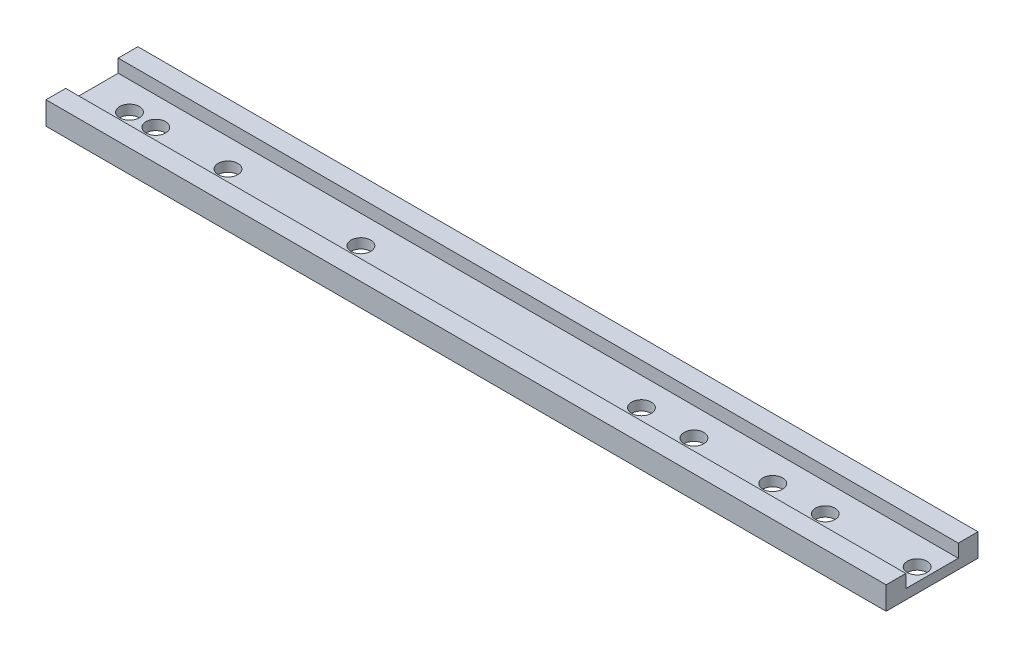
ISO-10303-21;
HEADER;
FILE_DESCRIPTION(('STEP AP214'),'2;1');
FILE_NAME('part.step','',(''),(''),'','','');
FILE_SCHEMA(('AUTOMOTIVE_DESIGN { 1 0 10303 214 1 1 1 1 }'));
ENDSEC;
DATA;
#1=APPLICATION_CONTEXT('core data for automotive mechanical design processes');
#2=APPLICATION_PROTOCOL_DEFINITION('international standard','automotive_design',2000,#1);
#3=PRODUCT_CONTEXT('',#1,'mechanical');
#4=PRODUCT('Part','Part','',(#3));
#5=PRODUCT_RELATED_PRODUCT_CATEGORY('part','',(#4));
#6=PRODUCT_DEFINITION_FORMATION('','',#4);
#7=PRODUCT_DEFINITION_CONTEXT('part definition',#1,'design');
#8=PRODUCT_DEFINITION('design','',#6,#7);
#9=PRODUCT_DEFINITION_SHAPE('','',#8);
#10=(LENGTH_UNIT() NAMED_UNIT(*) SI_UNIT(.MILLI.,.METRE.));
#11=(NAMED_UNIT(*) PLANE_ANGLE_UNIT() SI_UNIT($,.RADIAN.));
#12=(NAMED_UNIT(*) SI_UNIT($,.STERADIAN.) SOLID_ANGLE_UNIT());
#13=UNCERTAINTY_MEASURE_WITH_UNIT(LENGTH_MEASURE(1.E-05),#10,'distance_accuracy_value','');
#14=(GEOMETRIC_REPRESENTATION_CONTEXT(3) GLOBAL_UNCERTAINTY_ASSIGNED_CONTEXT((#13)) GLOBAL_UNIT_ASSIGNED_CONTEXT((#10,
#11,#12)) REPRESENTATION_CONTEXT('',''));
#15=CARTESIAN_POINT('',(0.,0.,0.));
#16=DIRECTION('',(0.,0.,1.));
#17=DIRECTION('',(1.,0.,0.));
#18=AXIS2_PLACEMENT_3D('',#15,#16,#17);
#19=CARTESIAN_POINT('',(211.2,6.88409090909091,11.825));
#20=DIRECTION('',(0.,-1.,0.));
#21=DIRECTION('',(0.,0.,-1.));
#22=AXIS2_PLACEMENT_3D('',#19,#20,#21);
#23=PLANE('',#22);
#24=DIRECTION('',(0.,0.,1.));
#25=VECTOR('',#24,1.);
#26=CARTESIAN_POINT('',(-195.2,6.88409090909091,11.825));
#27=LINE('',#26,#25);
#28=CARTESIAN_POINT('',(-195.2,6.88409090909091,11.825));
#29=VERTEX_POINT('',#28);
#30=CARTESIAN_POINT('',(-195.2,6.88409090909091,21.35));
#31=VERTEX_POINT('',#30);
#32=EDGE_CURVE('E134',#29,#31,#27,.T.);
#33=ORIENTED_EDGE('',*,*,#32,.T.);
#34=DIRECTION('',(-1.,0.,0.));
#35=VECTOR('',#34,1.);
#36=CARTESIAN_POINT('',(211.2,6.88409090909091,21.35));
#37=LINE('',#36,#35);
#38=CARTESIAN_POINT('',(211.2,6.88409090909091,21.35));
#39=VERTEX_POINT('',#38);
#40=EDGE_CURVE('E11',#39,#31,#37,.T.);
#41=ORIENTED_EDGE('',*,*,#40,.F.);
#42=DIRECTION('',(0.,0.,1.));
#43=VECTOR('',#42,1.);
#44=CARTESIAN_POINT('',(211.2,6.88409090909091,11.825));
#45=LINE('',#44,#43);
#46=CARTESIAN_POINT('',(211.2,6.88409090909091,11.825));
#47=VERTEX_POINT('',#46);
#48=EDGE_CURVE('E149',#47,#39,#45,.T.);
#49=ORIENTED_EDGE('',*,*,#48,.F.);
#50=DIRECTION('',(-1.,0.,0.));
#51=VECTOR('',#50,1.);
#52=CARTESIAN_POINT('',(211.2,6.88409090909091,11.825));
#53=LINE('',#52,#51);
#54=EDGE_CURVE('E130',#47,#29,#53,.T.);
#55=ORIENTED_EDGE('',*,*,#54,.T.);
#56=EDGE_LOOP('',(#33,#41,#49,#55));
#57=FACE_BOUND('',#56,.T.);
#58=ADVANCED_FACE('F36',(#57),#23,.F.);
#59=CARTESIAN_POINT('',(211.2,6.88409090909091,21.35));
#60=DIRECTION('',(0.,0.,-1.));
#61=DIRECTION('',(-1.,0.,0.));
#62=AXIS2_PLACEMENT_3D('',#59,#60,#61);
#63=PLANE('',#62);
#64=DIRECTION('',(0.,-1.,0.));
#65=VECTOR('',#64,1.);
#66=CARTESIAN_POINT('',(-195.2,6.88409090909091,21.35));
#67=LINE('',#66,#65);
#68=CARTESIAN_POINT('',(-195.2,-4.22840909090909,21.35));
#69=VERTEX_POINT('',#68);
#70=EDGE_CURVE('E137',#31,#69,#67,.T.);
#71=ORIENTED_EDGE('',*,*,#70,.T.);
#72=DIRECTION('',(-1.,0.,0.));
#73=VECTOR('',#72,1.);
#74=CARTESIAN_POINT('',(211.2,-4.22840909090909,21.35));
#75=LINE('',#74,#73);
#76=CARTESIAN_POINT('',(211.2,-4.22840909090909,21.35));
#77=VERTEX_POINT('',#76);
#78=EDGE_CURVE('E45',#77,#69,#75,.T.);
#79=ORIENTED_EDGE('',*,*,#78,.F.);
#80=DIRECTION('',(0.,-1.,0.));
#81=VECTOR('',#80,1.);
#82=CARTESIAN_POINT('',(211.2,6.88409090909091,21.35));
#83=LINE('',#82,#81);
#84=EDGE_CURVE('E97',#39,#77,#83,.T.);
#85=ORIENTED_EDGE('',*,*,#84,.F.);
#86=ORIENTED_EDGE('',*,*,#40,.T.);
#87=EDGE_LOOP('',(#71,#79,#85,#86));
#88=FACE_BOUND('',#87,.T.);
#89=ADVANCED_FACE('F248',(#88),#63,.F.);
#90=CARTESIAN_POINT('',(211.2,-4.22840909090909,21.35));
#91=DIRECTION('',(0.,1.,0.));
#92=DIRECTION('',(0.,0.,1.));
#93=AXIS2_PLACEMENT_3D('',#90,#91,#92);
#94=PLANE('',#93);
#95=CARTESIAN_POINT('',(204.85,-4.22840909090909,0.));
#96=DIRECTION('',(0.,-1.,0.));
#97=DIRECTION('',(0.,0.,-1.));
#98=AXIS2_PLACEMENT_3D('',#95,#96,#97);
#99=CIRCLE('',#98,4.76250000000001);
#100=CARTESIAN_POINT('',(204.85,-4.22840909090909,-4.76250000000001));
#101=VERTEX_POINT('',#100);
#102=EDGE_CURVE('E199',#101,#101,#99,.T.);
#103=ORIENTED_EDGE('',*,*,#102,.F.);
#104=EDGE_LOOP('',(#103));
#105=FACE_BOUND('',#104,.T.);
#106=CARTESIAN_POINT('',(160.4,-4.22840909090909,0.));
#107=DIRECTION('',(0.,-1.,0.));
#108=DIRECTION('',(0.,0.,-1.));
#109=AXIS2_PLACEMENT_3D('',#106,#107,#108);
#110=CIRCLE('',#109,4.76250000000001);
#111=CARTESIAN_POINT('',(160.4,-4.22840909090909,-4.76250000000001));
#112=VERTEX_POINT('',#111);
#113=EDGE_CURVE('E189',#112,#112,#110,.T.);
#114=ORIENTED_EDGE('',*,*,#113,.F.);
#115=EDGE_LOOP('',(#114));
#116=FACE_BOUND('',#115,.T.);
#117=CARTESIAN_POINT('',(135.,-4.22840909090909,0.));
#118=DIRECTION('',(0.,-1.,0.));
#119=DIRECTION('',(0.,0.,-1.));
#120=AXIS2_PLACEMENT_3D('',#117,#118,#119);
#121=CIRCLE('',#120,4.76250000000001);
#122=CARTESIAN_POINT('',(135.,-4.22840909090909,-4.76250000000001));
#123=VERTEX_POINT('',#122);
#124=EDGE_CURVE('E186',#123,#123,#121,.T.);
#125=ORIENTED_EDGE('',*,*,#124,.F.);
#126=EDGE_LOOP('',(#125));
#127=FACE_BOUND('',#126,.T.);
#128=CARTESIAN_POINT('',(96.9,-4.22840909090909,0.));
#129=DIRECTION('',(0.,-1.,0.));
#130=DIRECTION('',(0.,0.,-1.));
#131=AXIS2_PLACEMENT_3D('',#128,#129,#130);
#132=CIRCLE('',#131,4.7625);
#133=CARTESIAN_POINT('',(96.9,-4.22840909090909,-4.7625));
#134=VERTEX_POINT('',#133);
#135=EDGE_CURVE('E183',#134,#134,#132,.T.);
#136=ORIENTED_EDGE('',*,*,#135,.F.);
#137=EDGE_LOOP('',(#136));
#138=FACE_BOUND('',#137,.T.);
#139=CARTESIAN_POINT('',(71.5,-4.22840909090909,0.));
#140=DIRECTION('',(0.,-1.,0.));
#141=DIRECTION('',(0.,0.,-1.));
#142=AXIS2_PLACEMENT_3D('',#139,#140,#141);
#143=CIRCLE('',#142,4.7625);
#144=CARTESIAN_POINT('',(71.5,-4.22840909090909,-4.7625));
#145=VERTEX_POINT('',#144);
#146=EDGE_CURVE('E179',#145,#145,#143,.T.);
#147=ORIENTED_EDGE('',*,*,#146,.F.);
#148=EDGE_LOOP('',(#147));
#149=FACE_BOUND('',#148,.T.);
#150=CARTESIAN_POINT('',(-64.23125,-4.22840909090909,0.));
#151=DIRECTION('',(0.,-1.,0.));
#152=DIRECTION('',(0.,0.,-1.));
#153=AXIS2_PLACEMENT_3D('',#150,#151,#152);
#154=CIRCLE('',#153,4.7625);
#155=CARTESIAN_POINT('',(-64.23125,-4.22840909090909,-4.7625));
#156=VERTEX_POINT('',#155);
#157=EDGE_CURVE('E175',#156,#156,#154,.T.);
#158=ORIENTED_EDGE('',*,*,#157,.F.);
#159=EDGE_LOOP('',(#158));
#160=FACE_BOUND('',#159,.T.);
#161=CARTESIAN_POINT('',(-128.525,-4.22840909090909,0.));
#162=DIRECTION('',(0.,-1.,0.));
#163=DIRECTION('',(0.,0.,-1.));
#164=AXIS2_PLACEMENT_3D('',#161,#162,#163);
#165=CIRCLE('',#164,4.7625);
#166=CARTESIAN_POINT('',(-128.525,-4.22840909090909,-4.7625));
#167=VERTEX_POINT('',#166);
#168=EDGE_CURVE('E171',#167,#167,#165,.T.);
#169=ORIENTED_EDGE('',*,*,#168,.F.);
#170=EDGE_LOOP('',(#169));
#171=FACE_BOUND('',#170,.T.);
#172=CARTESIAN_POINT('',(-163.45,-4.22840909090909,0.));
#173=DIRECTION('',(0.,-1.,0.));
#174=DIRECTION('',(0.,0.,-1.));
#175=AXIS2_PLACEMENT_3D('',#172,#173,#174);
#176=CIRCLE('',#175,4.76250000000001);
#177=CARTESIAN_POINT('',(-163.45,-4.22840909090909,-4.76250000000001));
#178=VERTEX_POINT('',#177);
#179=EDGE_CURVE('E167',#178,#178,#176,.T.);
#180=ORIENTED_EDGE('',*,*,#179,.F.);
#181=EDGE_LOOP('',(#180));
#182=FACE_BOUND('',#181,.T.);
#183=CARTESIAN_POINT('',(-176.15,-4.22840909090909,0.));
#184=DIRECTION('',(0.,-1.,0.));
#185=DIRECTION('',(0.,0.,-1.));
#186=AXIS2_PLACEMENT_3D('',#183,#184,#185);
#187=CIRCLE('',#186,4.76250000000001);
#188=CARTESIAN_POINT('',(-176.15,-4.22840909090909,-4.76250000000001));
#189=VERTEX_POINT('',#188);
#190=EDGE_CURVE('E163',#189,#189,#187,.T.);
#191=ORIENTED_EDGE('',*,*,#190,.F.);
#192=EDGE_LOOP('',(#191));
#193=FACE_BOUND('',#192,.T.);
#194=DIRECTION('',(0.,0.,-1.));
#195=VECTOR('',#194,1.);
#196=CARTESIAN_POINT('',(-195.2,-4.22840909090909,21.35));
#197=LINE('',#196,#195);
#198=CARTESIAN_POINT('',(-195.2,-4.22840909090909,-23.1));
#199=VERTEX_POINT('',#198);
#200=EDGE_CURVE('E140',#69,#199,#197,.T.);
#201=ORIENTED_EDGE('',*,*,#200,.T.);
#202=DIRECTION('',(-1.,0.,0.));
#203=VECTOR('',#202,1.);
#204=CARTESIAN_POINT('',(211.2,-4.22840909090909,-23.1));
#205=LINE('',#204,#203);
#206=CARTESIAN_POINT('',(211.2,-4.22840909090909,-23.1));
#207=VERTEX_POINT('',#206);
#208=EDGE_CURVE('E156',#207,#199,#205,.T.);
#209=ORIENTED_EDGE('',*,*,#208,.F.);
#210=DIRECTION('',(0.,0.,-1.));
#211=VECTOR('',#210,1.);
#212=CARTESIAN_POINT('',(211.2,-4.22840909090909,21.35));
#213=LINE('',#212,#211);
#214=EDGE_CURVE('E216',#77,#207,#213,.T.);
#215=ORIENTED_EDGE('',*,*,#214,.F.);
#216=ORIENTED_EDGE('',*,*,#78,.T.);
#217=EDGE_LOOP('',(#201,#209,#215,#216));
#218=FACE_BOUND('',#217,.T.);
#219=ADVANCED_FACE('F252',(#105,#116,#127,#138,#149,#160,#171,#182,#193,#218),#94,.F.);
#220=CARTESIAN_POINT('',(211.2,-4.22840909090909,-23.1));
#221=DIRECTION('',(0.,0.,1.));
#222=DIRECTION('',(0.,-1.,0.));
#223=AXIS2_PLACEMENT_3D('',#220,#221,#222);
#224=PLANE('',#223);
#225=DIRECTION('',(0.,1.,0.));
#226=VECTOR('',#225,1.);
#227=CARTESIAN_POINT('',(-195.2,-4.22840909090909,-23.1));
#228=LINE('',#227,#226);
#229=CARTESIAN_POINT('',(-195.2,6.88409090909091,-23.1));
#230=VERTEX_POINT('',#229);
#231=EDGE_CURVE('E142',#199,#230,#228,.T.);
#232=ORIENTED_EDGE('',*,*,#231,.T.);
#233=DIRECTION('',(-1.,0.,0.));
#234=VECTOR('',#233,1.);
#235=CARTESIAN_POINT('',(211.2,6.88409090909091,-23.1));
#236=LINE('',#235,#234);
#237=CARTESIAN_POINT('',(211.2,6.88409090909091,-23.1));
#238=VERTEX_POINT('',#237);
#239=EDGE_CURVE('E153',#238,#230,#236,.T.);
#240=ORIENTED_EDGE('',*,*,#239,.F.);
#241=DIRECTION('',(0.,1.,0.));
#242=VECTOR('',#241,1.);
#243=CARTESIAN_POINT('',(211.2,-4.22840909090909,-23.1));
#244=LINE('',#243,#242);
#245=EDGE_CURVE('E218',#207,#238,#244,.T.);
#246=ORIENTED_EDGE('',*,*,#245,.F.);
#247=ORIENTED_EDGE('',*,*,#208,.T.);
#248=EDGE_LOOP('',(#232,#240,#246,#247));
#249=FACE_BOUND('',#248,.T.);
#250=ADVANCED_FACE('F224',(#249),#224,.F.);
#251=CARTESIAN_POINT('',(211.2,6.88409090909091,-23.1));
#252=DIRECTION('',(0.,-1.,0.));
#253=DIRECTION('',(0.,0.,-1.));
#254=AXIS2_PLACEMENT_3D('',#251,#252,#253);
#255=PLANE('',#254);
#256=DIRECTION('',(0.,0.,1.));
#257=VECTOR('',#256,1.);
#258=CARTESIAN_POINT('',(-195.2,6.88409090909091,-23.1));
#259=LINE('',#258,#257);
#260=CARTESIAN_POINT('',(-195.2,6.88409090909091,-13.575));
#261=VERTEX_POINT('',#260);
#262=EDGE_CURVE('E144',#230,#261,#259,.T.);
#263=ORIENTED_EDGE('',*,*,#262,.T.);
#264=DIRECTION('',(-1.,0.,0.));
#265=VECTOR('',#264,1.);
#266=CARTESIAN_POINT('',(211.2,6.88409090909091,-13.575));
#267=LINE('',#266,#265);
#268=CARTESIAN_POINT('',(211.2,6.88409090909091,-13.575));
#269=VERTEX_POINT('',#268);
#270=EDGE_CURVE('E125',#269,#261,#267,.T.);
#271=ORIENTED_EDGE('',*,*,#270,.F.);
#272=DIRECTION('',(0.,0.,1.));
#273=VECTOR('',#272,1.);
#274=CARTESIAN_POINT('',(211.2,6.88409090909091,-23.1));
#275=LINE('',#274,#273);
#276=EDGE_CURVE('E116',#238,#269,#275,.T.);
#277=ORIENTED_EDGE('',*,*,#276,.F.);
#278=ORIENTED_EDGE('',*,*,#239,.T.);
#279=EDGE_LOOP('',(#263,#271,#277,#278));
#280=FACE_BOUND('',#279,.T.);
#281=ADVANCED_FACE('F228',(#280),#255,.F.);
#282=CARTESIAN_POINT('',(211.2,6.88409090909091,-13.575));
#283=DIRECTION('',(0.,0.,-1.));
#284=DIRECTION('',(0.,1.,0.));
#285=AXIS2_PLACEMENT_3D('',#282,#283,#284);
#286=PLANE('',#285);
#287=DIRECTION('',(0.,-1.,0.));
#288=VECTOR('',#287,1.);
#289=CARTESIAN_POINT('',(-195.2,6.88409090909091,-13.575));
#290=LINE('',#289,#288);
#291=CARTESIAN_POINT('',(-195.2,0.534090909090912,-13.575));
#292=VERTEX_POINT('',#291);
#293=EDGE_CURVE('E124',#261,#292,#290,.T.);
#294=ORIENTED_EDGE('',*,*,#293,.T.);
#295=DIRECTION('',(-1.,0.,0.));
#296=VECTOR('',#295,1.);
#297=CARTESIAN_POINT('',(211.2,0.534090909090912,-13.575));
#298=LINE('',#297,#296);
#299=CARTESIAN_POINT('',(211.2,0.534090909090912,-13.575));
#300=VERTEX_POINT('',#299);
#301=EDGE_CURVE('E121',#300,#292,#298,.T.);
#302=ORIENTED_EDGE('',*,*,#301,.F.);
#303=DIRECTION('',(0.,-1.,0.));
#304=VECTOR('',#303,1.);
#305=CARTESIAN_POINT('',(211.2,6.88409090909091,-13.575));
#306=LINE('',#305,#304);
#307=EDGE_CURVE('E110',#269,#300,#306,.T.);
#308=ORIENTED_EDGE('',*,*,#307,.F.);
#309=ORIENTED_EDGE('',*,*,#270,.T.);
#310=EDGE_LOOP('',(#294,#302,#308,#309));
#311=FACE_BOUND('',#310,.T.);
#312=ADVANCED_FACE('F122',(#311),#286,.F.);
#313=CARTESIAN_POINT('',(211.2,0.534090909090912,-13.575));
#314=DIRECTION('',(0.,-1.,0.));
#315=DIRECTION('',(0.,0.,-1.));
#316=AXIS2_PLACEMENT_3D('',#313,#314,#315);
#317=PLANE('',#316);
#318=CARTESIAN_POINT('',(204.85,0.53409090909091,0.));
#319=DIRECTION('',(0.,-1.,0.));
#320=DIRECTION('',(0.,0.,-1.));
#321=AXIS2_PLACEMENT_3D('',#318,#319,#320);
#322=CIRCLE('',#321,4.76250000000001);
#323=CARTESIAN_POINT('',(204.85,0.534090909090911,-4.76250000000001));
#324=VERTEX_POINT('',#323);
#325=EDGE_CURVE('E39',#324,#324,#322,.T.);
#326=ORIENTED_EDGE('',*,*,#325,.T.);
#327=EDGE_LOOP('',(#326));
#328=FACE_BOUND('',#327,.T.);
#329=CARTESIAN_POINT('',(160.4,0.53409090909091,0.));
#330=DIRECTION('',(0.,-1.,0.));
#331=DIRECTION('',(0.,0.,-1.));
#332=AXIS2_PLACEMENT_3D('',#329,#330,#331);
#333=CIRCLE('',#332,4.76250000000001);
#334=CARTESIAN_POINT('',(160.4,0.534090909090911,-4.76250000000001));
#335=VERTEX_POINT('',#334);
#336=EDGE_CURVE('E187',#335,#335,#333,.T.);
#337=ORIENTED_EDGE('',*,*,#336,.T.);
#338=EDGE_LOOP('',(#337));
#339=FACE_BOUND('',#338,.T.);
#340=CARTESIAN_POINT('',(135.,0.53409090909091,0.));
#341=DIRECTION('',(0.,-1.,0.));
#342=DIRECTION('',(0.,0.,-1.));
#343=AXIS2_PLACEMENT_3D('',#340,#341,#342);
#344=CIRCLE('',#343,4.76250000000001);
#345=CARTESIAN_POINT('',(135.,0.534090909090911,-4.76250000000001));
#346=VERTEX_POINT('',#345);
#347=EDGE_CURVE('E184',#346,#346,#344,.T.);
#348=ORIENTED_EDGE('',*,*,#347,.T.);
#349=EDGE_LOOP('',(#348));
#350=FACE_BOUND('',#349,.T.);
#351=CARTESIAN_POINT('',(96.9,0.53409090909091,0.));
#352=DIRECTION('',(0.,-1.,0.));
#353=DIRECTION('',(0.,0.,-1.));
#354=AXIS2_PLACEMENT_3D('',#351,#352,#353);
#355=CIRCLE('',#354,4.7625);
#356=CARTESIAN_POINT('',(96.9,0.534090909090911,-4.7625));
#357=VERTEX_POINT('',#356);
#358=EDGE_CURVE('E180',#357,#357,#355,.T.);
#359=ORIENTED_EDGE('',*,*,#358,.T.);
#360=EDGE_LOOP('',(#359));
#361=FACE_BOUND('',#360,.T.);
#362=CARTESIAN_POINT('',(71.5,0.53409090909091,0.));
#363=DIRECTION('',(0.,-1.,0.));
#364=DIRECTION('',(0.,0.,-1.));
#365=AXIS2_PLACEMENT_3D('',#362,#363,#364);
#366=CIRCLE('',#365,4.7625);
#367=CARTESIAN_POINT('',(71.5,0.534090909090911,-4.7625));
#368=VERTEX_POINT('',#367);
#369=EDGE_CURVE('E176',#368,#368,#366,.T.);
#370=ORIENTED_EDGE('',*,*,#369,.T.);
#371=EDGE_LOOP('',(#370));
#372=FACE_BOUND('',#371,.T.);
#373=CARTESIAN_POINT('',(-64.23125,0.53409090909091,0.));
#374=DIRECTION('',(0.,-1.,0.));
#375=DIRECTION('',(0.,0.,-1.));
#376=AXIS2_PLACEMENT_3D('',#373,#374,#375);
#377=CIRCLE('',#376,4.7625);
#378=CARTESIAN_POINT('',(-64.23125,0.534090909090911,-4.7625));
#379=VERTEX_POINT('',#378);
#380=EDGE_CURVE('E172',#379,#379,#377,.T.);
#381=ORIENTED_EDGE('',*,*,#380,.T.);
#382=EDGE_LOOP('',(#381));
#383=FACE_BOUND('',#382,.T.);
#384=CARTESIAN_POINT('',(-128.525,0.53409090909091,0.));
#385=DIRECTION('',(0.,-1.,0.));
#386=DIRECTION('',(0.,0.,-1.));
#387=AXIS2_PLACEMENT_3D('',#384,#385,#386);
#388=CIRCLE('',#387,4.7625);
#389=CARTESIAN_POINT('',(-128.525,0.534090909090911,-4.7625));
#390=VERTEX_POINT('',#389);
#391=EDGE_CURVE('E168',#390,#390,#388,.T.);
#392=ORIENTED_EDGE('',*,*,#391,.T.);
#393=EDGE_LOOP('',(#392));
#394=FACE_BOUND('',#393,.T.);
#395=CARTESIAN_POINT('',(-163.45,0.53409090909091,0.));
#396=DIRECTION('',(0.,-1.,0.));
#397=DIRECTION('',(0.,0.,-1.));
#398=AXIS2_PLACEMENT_3D('',#395,#396,#397);
#399=CIRCLE('',#398,4.76250000000001);
#400=CARTESIAN_POINT('',(-163.45,0.534090909090911,-4.76250000000001));
#401=VERTEX_POINT('',#400);
#402=EDGE_CURVE('E164',#401,#401,#399,.T.);
#403=ORIENTED_EDGE('',*,*,#402,.T.);
#404=EDGE_LOOP('',(#403));
#405=FACE_BOUND('',#404,.T.);
#406=CARTESIAN_POINT('',(-176.15,0.53409090909091,0.));
#407=DIRECTION('',(0.,-1.,0.));
#408=DIRECTION('',(0.,0.,-1.));
#409=AXIS2_PLACEMENT_3D('',#406,#407,#408);
#410=CIRCLE('',#409,4.76250000000001);
#411=CARTESIAN_POINT('',(-176.15,0.534090909090911,-4.76250000000001));
#412=VERTEX_POINT('',#411);
#413=EDGE_CURVE('E138',#412,#412,#410,.T.);
#414=ORIENTED_EDGE('',*,*,#413,.T.);
#415=EDGE_LOOP('',(#414));
#416=FACE_BOUND('',#415,.T.);
#417=DIRECTION('',(0.,0.,1.));
#418=VECTOR('',#417,1.);
#419=CARTESIAN_POINT('',(-195.2,0.534090909090912,-13.575));
#420=LINE('',#419,#418);
#421=CARTESIAN_POINT('',(-195.2,0.534090909090908,11.825));
#422=VERTEX_POINT('',#421);
#423=EDGE_CURVE('E83',#292,#422,#420,.T.);
#424=ORIENTED_EDGE('',*,*,#423,.T.);
#425=DIRECTION('',(-1.,0.,0.));
#426=VECTOR('',#425,1.);
#427=CARTESIAN_POINT('',(211.2,0.534090909090908,11.825));
#428=LINE('',#427,#426);
#429=CARTESIAN_POINT('',(211.2,0.534090909090908,11.825));
#430=VERTEX_POINT('',#429);
#431=EDGE_CURVE('E126',#430,#422,#428,.T.);
#432=ORIENTED_EDGE('',*,*,#431,.F.);
#433=DIRECTION('',(0.,0.,1.));
#434=VECTOR('',#433,1.);
#435=CARTESIAN_POINT('',(211.2,0.534090909090912,-13.575));
#436=LINE('',#435,#434);
#437=EDGE_CURVE('E114',#300,#430,#436,.T.);
#438=ORIENTED_EDGE('',*,*,#437,.F.);
#439=ORIENTED_EDGE('',*,*,#301,.T.);
#440=EDGE_LOOP('',(#424,#432,#438,#439));
#441=FACE_BOUND('',#440,.T.);
#442=ADVANCED_FACE('F128',(#328,#339,#350,#361,#372,#383,#394,#405,#416,#441),#317,.F.);
#443=CARTESIAN_POINT('',(211.2,0.534090909090908,11.825));
#444=DIRECTION('',(0.,0.,1.));
#445=DIRECTION('',(0.,-1.,0.));
#446=AXIS2_PLACEMENT_3D('',#443,#444,#445);
#447=PLANE('',#446);
#448=DIRECTION('',(0.,1.,0.));
#449=VECTOR('',#448,1.);
#450=CARTESIAN_POINT('',(-195.2,0.534090909090908,11.825));
#451=LINE('',#450,#449);
#452=EDGE_CURVE('E89',#422,#29,#451,.T.);
#453=ORIENTED_EDGE('',*,*,#452,.T.);
#454=ORIENTED_EDGE('',*,*,#54,.F.);
#455=DIRECTION('',(0.,1.,0.));
#456=VECTOR('',#455,1.);
#457=CARTESIAN_POINT('',(211.2,0.534090909090908,11.825));
#458=LINE('',#457,#456);
#459=EDGE_CURVE('E54',#430,#47,#458,.T.);
#460=ORIENTED_EDGE('',*,*,#459,.F.);
#461=ORIENTED_EDGE('',*,*,#431,.T.);
#462=EDGE_LOOP('',(#453,#454,#460,#461));
#463=FACE_BOUND('',#462,.T.);
#464=ADVANCED_FACE('F236',(#463),#447,.F.);
#465=CARTESIAN_POINT('',(211.2,-4.22840909090909,21.35));
#466=DIRECTION('',(1.,0.,0.));
#467=DIRECTION('',(0.,0.,-1.));
#468=AXIS2_PLACEMENT_3D('',#465,#466,#467);
#469=PLANE('',#468);
#470=ORIENTED_EDGE('',*,*,#48,.T.);
#471=ORIENTED_EDGE('',*,*,#84,.T.);
#472=ORIENTED_EDGE('',*,*,#214,.T.);
#473=ORIENTED_EDGE('',*,*,#245,.T.);
#474=ORIENTED_EDGE('',*,*,#276,.T.);
#475=ORIENTED_EDGE('',*,*,#307,.T.);
#476=ORIENTED_EDGE('',*,*,#437,.T.);
#477=ORIENTED_EDGE('',*,*,#459,.T.);
#478=EDGE_LOOP('',(#470,#471,#472,#473,#474,#475,#476,#477));
#479=FACE_BOUND('',#478,.T.);
#480=ADVANCED_FACE('F112',(#479),#469,.T.);
#481=CARTESIAN_POINT('',(-195.2,-4.22840909090909,21.35));
#482=DIRECTION('',(1.,0.,0.));
#483=DIRECTION('',(0.,0.,-1.));
#484=AXIS2_PLACEMENT_3D('',#481,#482,#483);
#485=PLANE('',#484);
#486=ORIENTED_EDGE('',*,*,#32,.F.);
#487=ORIENTED_EDGE('',*,*,#452,.F.);
#488=ORIENTED_EDGE('',*,*,#423,.F.);
#489=ORIENTED_EDGE('',*,*,#293,.F.);
#490=ORIENTED_EDGE('',*,*,#262,.F.);
#491=ORIENTED_EDGE('',*,*,#231,.F.);
#492=ORIENTED_EDGE('',*,*,#200,.F.);
#493=ORIENTED_EDGE('',*,*,#70,.F.);
#494=EDGE_LOOP('',(#486,#487,#488,#489,#490,#491,#492,#493));
#495=FACE_BOUND('',#494,.T.);
#496=ADVANCED_FACE('F231',(#495),#485,.F.);
#497=CARTESIAN_POINT('',(-176.15,6.88409090909091,0.));
#498=DIRECTION('',(0.,-1.,0.));
#499=DIRECTION('',(0.,0.,-1.));
#500=AXIS2_PLACEMENT_3D('',#497,#498,#499);
#501=CYLINDRICAL_SURFACE('',#500,4.76250000000001);
#502=ORIENTED_EDGE('',*,*,#190,.T.);
#503=EDGE_LOOP('',(#502));
#504=FACE_BOUND('',#503,.T.);
#505=ORIENTED_EDGE('',*,*,#413,.F.);
#506=EDGE_LOOP('',(#505));
#507=FACE_BOUND('',#506,.T.);
#508=ADVANCED_FACE('F282',(#504,#507),#501,.F.);
#509=CARTESIAN_POINT('',(-163.45,6.88409090909091,0.));
#510=DIRECTION('',(0.,-1.,0.));
#511=DIRECTION('',(0.,0.,-1.));
#512=AXIS2_PLACEMENT_3D('',#509,#510,#511);
#513=CYLINDRICAL_SURFACE('',#512,4.76250000000001);
#514=ORIENTED_EDGE('',*,*,#179,.T.);
#515=EDGE_LOOP('',(#514));
#516=FACE_BOUND('',#515,.T.);
#517=ORIENTED_EDGE('',*,*,#402,.F.);
#518=EDGE_LOOP('',(#517));
#519=FACE_BOUND('',#518,.T.);
#520=ADVANCED_FACE('F287',(#516,#519),#513,.F.);
#521=CARTESIAN_POINT('',(-128.525,6.88409090909091,0.));
#522=DIRECTION('',(0.,-1.,0.));
#523=DIRECTION('',(0.,0.,-1.));
#524=AXIS2_PLACEMENT_3D('',#521,#522,#523);
#525=CYLINDRICAL_SURFACE('',#524,4.7625);
#526=ORIENTED_EDGE('',*,*,#168,.T.);
#527=EDGE_LOOP('',(#526));
#528=FACE_BOUND('',#527,.T.);
#529=ORIENTED_EDGE('',*,*,#391,.F.);
#530=EDGE_LOOP('',(#529));
#531=FACE_BOUND('',#530,.T.);
#532=ADVANCED_FACE('F299',(#528,#531),#525,.F.);
#533=CARTESIAN_POINT('',(-64.23125,6.88409090909091,0.));
#534=DIRECTION('',(0.,-1.,0.));
#535=DIRECTION('',(0.,0.,-1.));
#536=AXIS2_PLACEMENT_3D('',#533,#534,#535);
#537=CYLINDRICAL_SURFACE('',#536,4.7625);
#538=ORIENTED_EDGE('',*,*,#157,.T.);
#539=EDGE_LOOP('',(#538));
#540=FACE_BOUND('',#539,.T.);
#541=ORIENTED_EDGE('',*,*,#380,.F.);
#542=EDGE_LOOP('',(#541));
#543=FACE_BOUND('',#542,.T.);
#544=ADVANCED_FACE('F309',(#540,#543),#537,.F.);
#545=CARTESIAN_POINT('',(71.5,6.88409090909091,0.));
#546=DIRECTION('',(0.,-1.,0.));
#547=DIRECTION('',(0.,0.,-1.));
#548=AXIS2_PLACEMENT_3D('',#545,#546,#547);
#549=CYLINDRICAL_SURFACE('',#548,4.7625);
#550=ORIENTED_EDGE('',*,*,#146,.T.);
#551=EDGE_LOOP('',(#550));
#552=FACE_BOUND('',#551,.T.);
#553=ORIENTED_EDGE('',*,*,#369,.F.);
#554=EDGE_LOOP('',(#553));
#555=FACE_BOUND('',#554,.T.);
#556=ADVANCED_FACE('F319',(#552,#555),#549,.F.);
#557=CARTESIAN_POINT('',(96.9,6.88409090909091,0.));
#558=DIRECTION('',(0.,-1.,0.));
#559=DIRECTION('',(0.,0.,-1.));
#560=AXIS2_PLACEMENT_3D('',#557,#558,#559);
#561=CYLINDRICAL_SURFACE('',#560,4.7625);
#562=ORIENTED_EDGE('',*,*,#135,.T.);
#563=EDGE_LOOP('',(#562));
#564=FACE_BOUND('',#563,.T.);
#565=ORIENTED_EDGE('',*,*,#358,.F.);
#566=EDGE_LOOP('',(#565));
#567=FACE_BOUND('',#566,.T.);
#568=ADVANCED_FACE('F329',(#564,#567),#561,.F.);
#569=CARTESIAN_POINT('',(135.,6.88409090909091,0.));
#570=DIRECTION('',(0.,-1.,0.));
#571=DIRECTION('',(0.,0.,-1.));
#572=AXIS2_PLACEMENT_3D('',#569,#570,#571);
#573=CYLINDRICAL_SURFACE('',#572,4.76250000000001);
#574=ORIENTED_EDGE('',*,*,#124,.T.);
#575=EDGE_LOOP('',(#574));
#576=FACE_BOUND('',#575,.T.);
#577=ORIENTED_EDGE('',*,*,#347,.F.);
#578=EDGE_LOOP('',(#577));
#579=FACE_BOUND('',#578,.T.);
#580=ADVANCED_FACE('F339',(#576,#579),#573,.F.);
#581=CARTESIAN_POINT('',(160.4,6.88409090909091,0.));
#582=DIRECTION('',(0.,-1.,0.));
#583=DIRECTION('',(0.,0.,-1.));
#584=AXIS2_PLACEMENT_3D('',#581,#582,#583);
#585=CYLINDRICAL_SURFACE('',#584,4.76250000000001);
#586=ORIENTED_EDGE('',*,*,#113,.T.);
#587=EDGE_LOOP('',(#586));
#588=FACE_BOUND('',#587,.T.);
#589=ORIENTED_EDGE('',*,*,#336,.F.);
#590=EDGE_LOOP('',(#589));
#591=FACE_BOUND('',#590,.T.);
#592=ADVANCED_FACE('F349',(#588,#591),#585,.F.);
#593=CARTESIAN_POINT('',(204.85,6.88409090909091,0.));
#594=DIRECTION('',(0.,-1.,0.));
#595=DIRECTION('',(0.,0.,-1.));
#596=AXIS2_PLACEMENT_3D('',#593,#594,#595);
#597=CYLINDRICAL_SURFACE('',#596,4.76250000000001);
#598=ORIENTED_EDGE('',*,*,#102,.T.);
#599=EDGE_LOOP('',(#598));
#600=FACE_BOUND('',#599,.T.);
#601=ORIENTED_EDGE('',*,*,#325,.F.);
#602=EDGE_LOOP('',(#601));
#603=FACE_BOUND('',#602,.T.);
#604=ADVANCED_FACE('F359',(#600,#603),#597,.F.);
#605=CLOSED_SHELL('',(#58,#89,#219,#250,#281,#312,#442,#464,#480,#496,#508,#520,#532,#544,#556,
#568,#580,#592,#604));
#606=MANIFOLD_SOLID_BREP('B2',#605);
#607=ADVANCED_BREP_SHAPE_REPRESENTATION('',(#18,#606),#14);
#608=SHAPE_DEFINITION_REPRESENTATION(#9,#607);
ENDSEC;
END-ISO-10303-21;
